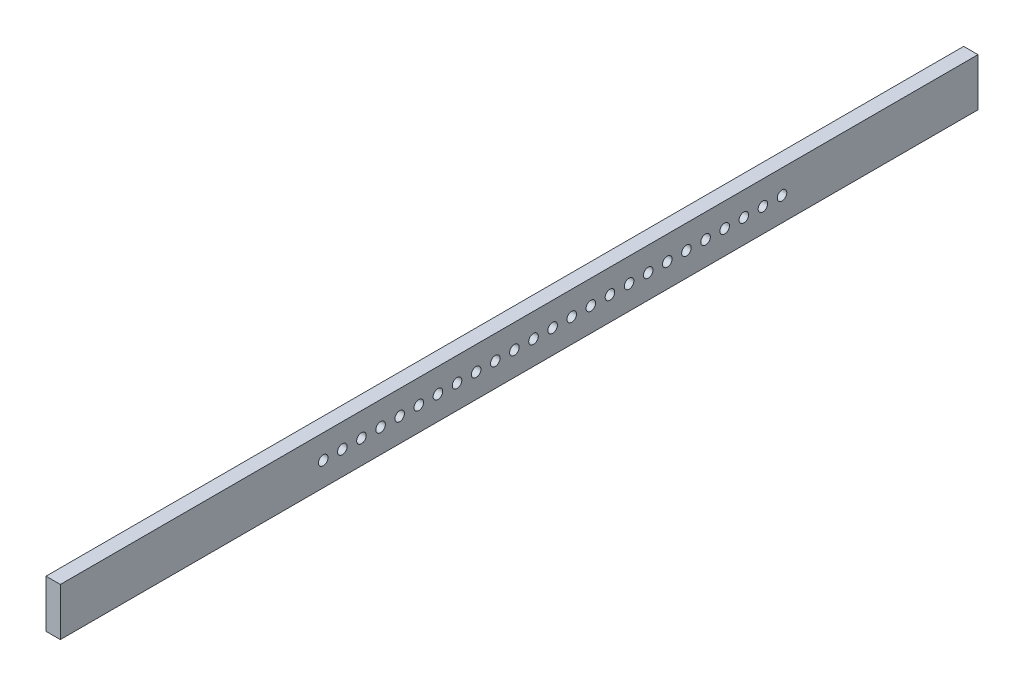
ISO-10303-21;
HEADER;
FILE_DESCRIPTION(('STEP AP214'),'2;1');
FILE_NAME('part.step','',(''),(''),'','','');
FILE_SCHEMA(('AUTOMOTIVE_DESIGN { 1 0 10303 214 1 1 1 1 }'));
ENDSEC;
DATA;
#1=APPLICATION_CONTEXT('core data for automotive mechanical design processes');
#2=APPLICATION_PROTOCOL_DEFINITION('international standard','automotive_design',2000,#1);
#3=PRODUCT_CONTEXT('',#1,'mechanical');
#4=PRODUCT('Part','Part','',(#3));
#5=PRODUCT_RELATED_PRODUCT_CATEGORY('part','',(#4));
#6=PRODUCT_DEFINITION_FORMATION('','',#4);
#7=PRODUCT_DEFINITION_CONTEXT('part definition',#1,'design');
#8=PRODUCT_DEFINITION('design','',#6,#7);
#9=PRODUCT_DEFINITION_SHAPE('','',#8);
#10=(LENGTH_UNIT() NAMED_UNIT(*) SI_UNIT(.MILLI.,.METRE.));
#11=(NAMED_UNIT(*) PLANE_ANGLE_UNIT() SI_UNIT($,.RADIAN.));
#12=(NAMED_UNIT(*) SI_UNIT($,.STERADIAN.) SOLID_ANGLE_UNIT());
#13=UNCERTAINTY_MEASURE_WITH_UNIT(LENGTH_MEASURE(1.E-05),#10,'distance_accuracy_value','');
#14=(GEOMETRIC_REPRESENTATION_CONTEXT(3) GLOBAL_UNCERTAINTY_ASSIGNED_CONTEXT((#13)) GLOBAL_UNIT_ASSIGNED_CONTEXT((#10,
#11,#12)) REPRESENTATION_CONTEXT('',''));
#15=CARTESIAN_POINT('',(0.,0.,0.));
#16=DIRECTION('',(0.,0.,1.));
#17=DIRECTION('',(1.,0.,0.));
#18=AXIS2_PLACEMENT_3D('',#15,#16,#17);
#19=CARTESIAN_POINT('',(15.,0.,0.));
#20=DIRECTION('',(1.,0.,0.));
#21=DIRECTION('',(0.,0.,-1.));
#22=AXIS2_PLACEMENT_3D('',#19,#20,#21);
#23=PLANE('',#22);
#24=CARTESIAN_POINT('',(15.,0.,-255.));
#25=DIRECTION('',(1.,0.,0.));
#26=DIRECTION('',(0.,0.,-1.));
#27=AXIS2_PLACEMENT_3D('',#24,#25,#26);
#28=CIRCLE('',#27,4.99999999999999);
#29=CARTESIAN_POINT('',(15.,0.,-260.));
#30=VERTEX_POINT('',#29);
#31=EDGE_CURVE('E246',#30,#30,#28,.T.);
#32=ORIENTED_EDGE('',*,*,#31,.F.);
#33=EDGE_LOOP('',(#32));
#34=FACE_BOUND('',#33,.T.);
#35=CARTESIAN_POINT('',(15.,0.,-215.));
#36=DIRECTION('',(1.,0.,0.));
#37=DIRECTION('',(0.,0.,-1.));
#38=AXIS2_PLACEMENT_3D('',#35,#36,#37);
#39=CIRCLE('',#38,4.99999999999999);
#40=CARTESIAN_POINT('',(15.,0.,-220.));
#41=VERTEX_POINT('',#40);
#42=EDGE_CURVE('E234',#41,#41,#39,.T.);
#43=ORIENTED_EDGE('',*,*,#42,.F.);
#44=EDGE_LOOP('',(#43));
#45=FACE_BOUND('',#44,.T.);
#46=CARTESIAN_POINT('',(15.,0.,-155.));
#47=DIRECTION('',(1.,0.,0.));
#48=DIRECTION('',(0.,0.,-1.));
#49=AXIS2_PLACEMENT_3D('',#46,#47,#48);
#50=CIRCLE('',#49,4.99999999999999);
#51=CARTESIAN_POINT('',(15.,0.,-160.));
#52=VERTEX_POINT('',#51);
#53=EDGE_CURVE('E222',#52,#52,#50,.T.);
#54=ORIENTED_EDGE('',*,*,#53,.F.);
#55=EDGE_LOOP('',(#54));
#56=FACE_BOUND('',#55,.T.);
#57=CARTESIAN_POINT('',(15.,0.,-115.));
#58=DIRECTION('',(1.,0.,0.));
#59=DIRECTION('',(0.,0.,-1.));
#60=AXIS2_PLACEMENT_3D('',#57,#58,#59);
#61=CIRCLE('',#60,4.99999999999999);
#62=CARTESIAN_POINT('',(15.,0.,-120.));
#63=VERTEX_POINT('',#62);
#64=EDGE_CURVE('E210',#63,#63,#61,.T.);
#65=ORIENTED_EDGE('',*,*,#64,.F.);
#66=EDGE_LOOP('',(#65));
#67=FACE_BOUND('',#66,.T.);
#68=CARTESIAN_POINT('',(15.,0.,-75.0000000000001));
#69=DIRECTION('',(1.,0.,0.));
#70=DIRECTION('',(0.,0.,-1.));
#71=AXIS2_PLACEMENT_3D('',#68,#69,#70);
#72=CIRCLE('',#71,4.99999999999999);
#73=CARTESIAN_POINT('',(15.,0.,-80.0000000000001));
#74=VERTEX_POINT('',#73);
#75=EDGE_CURVE('E198',#74,#74,#72,.T.);
#76=ORIENTED_EDGE('',*,*,#75,.F.);
#77=EDGE_LOOP('',(#76));
#78=FACE_BOUND('',#77,.T.);
#79=CARTESIAN_POINT('',(15.,0.,-35.0000000000001));
#80=DIRECTION('',(1.,0.,0.));
#81=DIRECTION('',(0.,0.,-1.));
#82=AXIS2_PLACEMENT_3D('',#79,#80,#81);
#83=CIRCLE('',#82,4.99999999999999);
#84=CARTESIAN_POINT('',(15.,0.,-40.0000000000001));
#85=VERTEX_POINT('',#84);
#86=EDGE_CURVE('E186',#85,#85,#83,.T.);
#87=ORIENTED_EDGE('',*,*,#86,.F.);
#88=EDGE_LOOP('',(#87));
#89=FACE_BOUND('',#88,.T.);
#90=CARTESIAN_POINT('',(15.,0.,4.99999999999989));
#91=DIRECTION('',(1.,0.,0.));
#92=DIRECTION('',(0.,0.,-1.));
#93=AXIS2_PLACEMENT_3D('',#90,#91,#92);
#94=CIRCLE('',#93,4.99999999999996);
#95=CARTESIAN_POINT('',(15.,0.,0.));
#96=VERTEX_POINT('',#95);
#97=EDGE_CURVE('E174',#96,#96,#94,.T.);
#98=ORIENTED_EDGE('',*,*,#97,.F.);
#99=EDGE_LOOP('',(#98));
#100=FACE_BOUND('',#99,.T.);
#101=CARTESIAN_POINT('',(15.,0.,44.9999999999999));
#102=DIRECTION('',(1.,0.,0.));
#103=DIRECTION('',(0.,0.,-1.));
#104=AXIS2_PLACEMENT_3D('',#101,#102,#103);
#105=CIRCLE('',#104,4.99999999999999);
#106=CARTESIAN_POINT('',(15.,0.,39.9999999999999));
#107=VERTEX_POINT('',#106);
#108=EDGE_CURVE('E162',#107,#107,#105,.T.);
#109=ORIENTED_EDGE('',*,*,#108,.F.);
#110=EDGE_LOOP('',(#109));
#111=FACE_BOUND('',#110,.T.);
#112=CARTESIAN_POINT('',(15.,0.,84.9999999999999));
#113=DIRECTION('',(1.,0.,0.));
#114=DIRECTION('',(0.,0.,-1.));
#115=AXIS2_PLACEMENT_3D('',#112,#113,#114);
#116=CIRCLE('',#115,5.00000000000005);
#117=CARTESIAN_POINT('',(15.,0.,79.9999999999999));
#118=VERTEX_POINT('',#117);
#119=EDGE_CURVE('E150',#118,#118,#116,.T.);
#120=ORIENTED_EDGE('',*,*,#119,.F.);
#121=EDGE_LOOP('',(#120));
#122=FACE_BOUND('',#121,.T.);
#123=CARTESIAN_POINT('',(15.,0.,125.));
#124=DIRECTION('',(1.,0.,0.));
#125=DIRECTION('',(0.,0.,-1.));
#126=AXIS2_PLACEMENT_3D('',#123,#124,#125);
#127=CIRCLE('',#126,4.99999999999999);
#128=CARTESIAN_POINT('',(15.,0.,120.));
#129=VERTEX_POINT('',#128);
#130=EDGE_CURVE('E138',#129,#129,#127,.T.);
#131=ORIENTED_EDGE('',*,*,#130,.F.);
#132=EDGE_LOOP('',(#131));
#133=FACE_BOUND('',#132,.T.);
#134=CARTESIAN_POINT('',(15.,0.,165.));
#135=DIRECTION('',(1.,0.,0.));
#136=DIRECTION('',(0.,0.,-1.));
#137=AXIS2_PLACEMENT_3D('',#134,#135,#136);
#138=CIRCLE('',#137,4.99999999999993);
#139=CARTESIAN_POINT('',(15.,0.,160.));
#140=VERTEX_POINT('',#139);
#141=EDGE_CURVE('E126',#140,#140,#138,.T.);
#142=ORIENTED_EDGE('',*,*,#141,.F.);
#143=EDGE_LOOP('',(#142));
#144=FACE_BOUND('',#143,.T.);
#145=CARTESIAN_POINT('',(15.,0.,-195.));
#146=DIRECTION('',(1.,0.,0.));
#147=DIRECTION('',(0.,0.,-1.));
#148=AXIS2_PLACEMENT_3D('',#145,#146,#147);
#149=CIRCLE('',#148,4.99999999999999);
#150=CARTESIAN_POINT('',(15.,0.,-200.));
#151=VERTEX_POINT('',#150);
#152=EDGE_CURVE('E114',#151,#151,#149,.T.);
#153=ORIENTED_EDGE('',*,*,#152,.F.);
#154=EDGE_LOOP('',(#153));
#155=FACE_BOUND('',#154,.T.);
#156=DIRECTION('',(0.,1.,0.));
#157=VECTOR('',#156,1.);
#158=CARTESIAN_POINT('',(15.,25.,-480.));
#159=LINE('',#158,#157);
#160=CARTESIAN_POINT('',(15.,-25.,-480.));
#161=VERTEX_POINT('',#160);
#162=CARTESIAN_POINT('',(15.,25.,-480.));
#163=VERTEX_POINT('',#162);
#164=EDGE_CURVE('E84',#161,#163,#159,.T.);
#165=ORIENTED_EDGE('',*,*,#164,.T.);
#166=DIRECTION('',(0.,0.,1.));
#167=VECTOR('',#166,1.);
#168=CARTESIAN_POINT('',(15.,25.,480.));
#169=LINE('',#168,#167);
#170=CARTESIAN_POINT('',(15.,25.,480.));
#171=VERTEX_POINT('',#170);
#172=EDGE_CURVE('E79',#163,#171,#169,.T.);
#173=ORIENTED_EDGE('',*,*,#172,.T.);
#174=DIRECTION('',(0.,-1.,0.));
#175=VECTOR('',#174,1.);
#176=CARTESIAN_POINT('',(15.,25.,480.));
#177=LINE('',#176,#175);
#178=CARTESIAN_POINT('',(15.,-25.,480.));
#179=VERTEX_POINT('',#178);
#180=EDGE_CURVE('E82',#171,#179,#177,.T.);
#181=ORIENTED_EDGE('',*,*,#180,.T.);
#182=DIRECTION('',(0.,0.,-1.));
#183=VECTOR('',#182,1.);
#184=CARTESIAN_POINT('',(15.,-25.,480.));
#185=LINE('',#184,#183);
#186=EDGE_CURVE('E49',#179,#161,#185,.T.);
#187=ORIENTED_EDGE('',*,*,#186,.T.);
#188=EDGE_LOOP('',(#165,#173,#181,#187));
#189=FACE_BOUND('',#188,.T.);
#190=CARTESIAN_POINT('',(15.,0.,205.));
#191=DIRECTION('',(1.,0.,0.));
#192=DIRECTION('',(0.,0.,-1.));
#193=AXIS2_PLACEMENT_3D('',#190,#191,#192);
#194=CIRCLE('',#193,4.99999999999999);
#195=CARTESIAN_POINT('',(15.,0.,200.));
#196=VERTEX_POINT('',#195);
#197=EDGE_CURVE('E99',#196,#196,#194,.T.);
#198=ORIENTED_EDGE('',*,*,#197,.F.);
#199=EDGE_LOOP('',(#198));
#200=FACE_BOUND('',#199,.T.);
#201=CARTESIAN_POINT('',(15.,0.,185.));
#202=DIRECTION('',(1.,0.,0.));
#203=DIRECTION('',(0.,0.,-1.));
#204=AXIS2_PLACEMENT_3D('',#201,#202,#203);
#205=CIRCLE('',#204,4.99999999999999);
#206=CARTESIAN_POINT('',(15.,0.,180.));
#207=VERTEX_POINT('',#206);
#208=EDGE_CURVE('E120',#207,#207,#205,.T.);
#209=ORIENTED_EDGE('',*,*,#208,.F.);
#210=EDGE_LOOP('',(#209));
#211=FACE_BOUND('',#210,.T.);
#212=CARTESIAN_POINT('',(15.,0.,145.));
#213=DIRECTION('',(1.,0.,0.));
#214=DIRECTION('',(0.,0.,-1.));
#215=AXIS2_PLACEMENT_3D('',#212,#213,#214);
#216=CIRCLE('',#215,4.99999999999999);
#217=CARTESIAN_POINT('',(15.,0.,140.));
#218=VERTEX_POINT('',#217);
#219=EDGE_CURVE('E132',#218,#218,#216,.T.);
#220=ORIENTED_EDGE('',*,*,#219,.F.);
#221=EDGE_LOOP('',(#220));
#222=FACE_BOUND('',#221,.T.);
#223=CARTESIAN_POINT('',(15.,0.,105.));
#224=DIRECTION('',(1.,0.,0.));
#225=DIRECTION('',(0.,0.,-1.));
#226=AXIS2_PLACEMENT_3D('',#223,#224,#225);
#227=CIRCLE('',#226,4.99999999999999);
#228=CARTESIAN_POINT('',(15.,0.,99.9999999999999));
#229=VERTEX_POINT('',#228);
#230=EDGE_CURVE('E144',#229,#229,#227,.T.);
#231=ORIENTED_EDGE('',*,*,#230,.F.);
#232=EDGE_LOOP('',(#231));
#233=FACE_BOUND('',#232,.T.);
#234=CARTESIAN_POINT('',(15.,0.,64.9999999999999));
#235=DIRECTION('',(1.,0.,0.));
#236=DIRECTION('',(0.,0.,-1.));
#237=AXIS2_PLACEMENT_3D('',#234,#235,#236);
#238=CIRCLE('',#237,4.99999999999999);
#239=CARTESIAN_POINT('',(15.,0.,59.9999999999999));
#240=VERTEX_POINT('',#239);
#241=EDGE_CURVE('E156',#240,#240,#238,.T.);
#242=ORIENTED_EDGE('',*,*,#241,.F.);
#243=EDGE_LOOP('',(#242));
#244=FACE_BOUND('',#243,.T.);
#245=CARTESIAN_POINT('',(15.,0.,24.9999999999999));
#246=DIRECTION('',(1.,0.,0.));
#247=DIRECTION('',(0.,0.,-1.));
#248=AXIS2_PLACEMENT_3D('',#245,#246,#247);
#249=CIRCLE('',#248,4.99999999999999);
#250=CARTESIAN_POINT('',(15.,0.,19.9999999999999));
#251=VERTEX_POINT('',#250);
#252=EDGE_CURVE('E168',#251,#251,#249,.T.);
#253=ORIENTED_EDGE('',*,*,#252,.F.);
#254=EDGE_LOOP('',(#253));
#255=FACE_BOUND('',#254,.T.);
#256=CARTESIAN_POINT('',(15.,0.,-15.0000000000001));
#257=DIRECTION('',(1.,0.,0.));
#258=DIRECTION('',(0.,0.,-1.));
#259=AXIS2_PLACEMENT_3D('',#256,#257,#258);
#260=CIRCLE('',#259,4.99999999999999);
#261=CARTESIAN_POINT('',(15.,0.,-20.0000000000001));
#262=VERTEX_POINT('',#261);
#263=EDGE_CURVE('E180',#262,#262,#260,.T.);
#264=ORIENTED_EDGE('',*,*,#263,.F.);
#265=EDGE_LOOP('',(#264));
#266=FACE_BOUND('',#265,.T.);
#267=CARTESIAN_POINT('',(15.,0.,-55.0000000000001));
#268=DIRECTION('',(1.,0.,0.));
#269=DIRECTION('',(0.,0.,-1.));
#270=AXIS2_PLACEMENT_3D('',#267,#268,#269);
#271=CIRCLE('',#270,4.99999999999999);
#272=CARTESIAN_POINT('',(15.,0.,-60.0000000000001));
#273=VERTEX_POINT('',#272);
#274=EDGE_CURVE('E192',#273,#273,#271,.T.);
#275=ORIENTED_EDGE('',*,*,#274,.F.);
#276=EDGE_LOOP('',(#275));
#277=FACE_BOUND('',#276,.T.);
#278=CARTESIAN_POINT('',(15.,0.,-95.0000000000001));
#279=DIRECTION('',(1.,0.,0.));
#280=DIRECTION('',(0.,0.,-1.));
#281=AXIS2_PLACEMENT_3D('',#278,#279,#280);
#282=CIRCLE('',#281,4.99999999999999);
#283=CARTESIAN_POINT('',(15.,0.,-100.));
#284=VERTEX_POINT('',#283);
#285=EDGE_CURVE('E204',#284,#284,#282,.T.);
#286=ORIENTED_EDGE('',*,*,#285,.F.);
#287=EDGE_LOOP('',(#286));
#288=FACE_BOUND('',#287,.T.);
#289=CARTESIAN_POINT('',(15.,0.,-135.));
#290=DIRECTION('',(1.,0.,0.));
#291=DIRECTION('',(0.,0.,-1.));
#292=AXIS2_PLACEMENT_3D('',#289,#290,#291);
#293=CIRCLE('',#292,4.99999999999999);
#294=CARTESIAN_POINT('',(15.,0.,-140.));
#295=VERTEX_POINT('',#294);
#296=EDGE_CURVE('E216',#295,#295,#293,.T.);
#297=ORIENTED_EDGE('',*,*,#296,.F.);
#298=EDGE_LOOP('',(#297));
#299=FACE_BOUND('',#298,.T.);
#300=CARTESIAN_POINT('',(15.,0.,-175.));
#301=DIRECTION('',(1.,0.,0.));
#302=DIRECTION('',(0.,0.,-1.));
#303=AXIS2_PLACEMENT_3D('',#300,#301,#302);
#304=CIRCLE('',#303,4.99999999999999);
#305=CARTESIAN_POINT('',(15.,0.,-180.));
#306=VERTEX_POINT('',#305);
#307=EDGE_CURVE('E228',#306,#306,#304,.T.);
#308=ORIENTED_EDGE('',*,*,#307,.F.);
#309=EDGE_LOOP('',(#308));
#310=FACE_BOUND('',#309,.T.);
#311=CARTESIAN_POINT('',(15.,0.,-235.));
#312=DIRECTION('',(1.,0.,0.));
#313=DIRECTION('',(0.,0.,-1.));
#314=AXIS2_PLACEMENT_3D('',#311,#312,#313);
#315=CIRCLE('',#314,4.99999999999999);
#316=CARTESIAN_POINT('',(15.,0.,-240.));
#317=VERTEX_POINT('',#316);
#318=EDGE_CURVE('E240',#317,#317,#315,.T.);
#319=ORIENTED_EDGE('',*,*,#318,.F.);
#320=EDGE_LOOP('',(#319));
#321=FACE_BOUND('',#320,.T.);
#322=CARTESIAN_POINT('',(15.,0.,-275.));
#323=DIRECTION('',(1.,0.,0.));
#324=DIRECTION('',(0.,0.,-1.));
#325=AXIS2_PLACEMENT_3D('',#322,#323,#324);
#326=CIRCLE('',#325,4.99999999999999);
#327=CARTESIAN_POINT('',(15.,0.,-280.));
#328=VERTEX_POINT('',#327);
#329=EDGE_CURVE('E252',#328,#328,#326,.T.);
#330=ORIENTED_EDGE('',*,*,#329,.F.);
#331=EDGE_LOOP('',(#330));
#332=FACE_BOUND('',#331,.T.);
#333=ADVANCED_FACE('F32',(#34,#45,#56,#67,#78,#89,#100,#111,#122,#133,#144,#155,#189,#200,#211,
#222,#233,#244,#255,#266,#277,#288,#299,#310,#321,#332),#23,.T.);
#334=CARTESIAN_POINT('',(0.,0.,0.));
#335=DIRECTION('',(1.,0.,0.));
#336=DIRECTION('',(0.,0.,-1.));
#337=AXIS2_PLACEMENT_3D('',#334,#335,#336);
#338=PLANE('',#337);
#339=CARTESIAN_POINT('',(0.,0.,-255.));
#340=DIRECTION('',(1.,0.,0.));
#341=DIRECTION('',(0.,0.,-1.));
#342=AXIS2_PLACEMENT_3D('',#339,#340,#341);
#343=CIRCLE('',#342,4.99999999999999);
#344=CARTESIAN_POINT('',(0.,0.,-260.));
#345=VERTEX_POINT('',#344);
#346=EDGE_CURVE('E249',#345,#345,#343,.T.);
#347=ORIENTED_EDGE('',*,*,#346,.T.);
#348=EDGE_LOOP('',(#347));
#349=FACE_BOUND('',#348,.T.);
#350=CARTESIAN_POINT('',(0.,0.,-215.));
#351=DIRECTION('',(1.,0.,0.));
#352=DIRECTION('',(0.,0.,-1.));
#353=AXIS2_PLACEMENT_3D('',#350,#351,#352);
#354=CIRCLE('',#353,4.99999999999999);
#355=CARTESIAN_POINT('',(0.,0.,-220.));
#356=VERTEX_POINT('',#355);
#357=EDGE_CURVE('E237',#356,#356,#354,.T.);
#358=ORIENTED_EDGE('',*,*,#357,.T.);
#359=EDGE_LOOP('',(#358));
#360=FACE_BOUND('',#359,.T.);
#361=CARTESIAN_POINT('',(0.,0.,-155.));
#362=DIRECTION('',(1.,0.,0.));
#363=DIRECTION('',(0.,0.,-1.));
#364=AXIS2_PLACEMENT_3D('',#361,#362,#363);
#365=CIRCLE('',#364,4.99999999999999);
#366=CARTESIAN_POINT('',(0.,0.,-160.));
#367=VERTEX_POINT('',#366);
#368=EDGE_CURVE('E225',#367,#367,#365,.T.);
#369=ORIENTED_EDGE('',*,*,#368,.T.);
#370=EDGE_LOOP('',(#369));
#371=FACE_BOUND('',#370,.T.);
#372=CARTESIAN_POINT('',(0.,0.,-115.));
#373=DIRECTION('',(1.,0.,0.));
#374=DIRECTION('',(0.,0.,-1.));
#375=AXIS2_PLACEMENT_3D('',#372,#373,#374);
#376=CIRCLE('',#375,4.99999999999999);
#377=CARTESIAN_POINT('',(0.,0.,-120.));
#378=VERTEX_POINT('',#377);
#379=EDGE_CURVE('E213',#378,#378,#376,.T.);
#380=ORIENTED_EDGE('',*,*,#379,.T.);
#381=EDGE_LOOP('',(#380));
#382=FACE_BOUND('',#381,.T.);
#383=CARTESIAN_POINT('',(0.,0.,-75.0000000000001));
#384=DIRECTION('',(1.,0.,0.));
#385=DIRECTION('',(0.,0.,-1.));
#386=AXIS2_PLACEMENT_3D('',#383,#384,#385);
#387=CIRCLE('',#386,4.99999999999999);
#388=CARTESIAN_POINT('',(0.,0.,-80.0000000000001));
#389=VERTEX_POINT('',#388);
#390=EDGE_CURVE('E201',#389,#389,#387,.T.);
#391=ORIENTED_EDGE('',*,*,#390,.T.);
#392=EDGE_LOOP('',(#391));
#393=FACE_BOUND('',#392,.T.);
#394=CARTESIAN_POINT('',(0.,0.,-35.0000000000001));
#395=DIRECTION('',(1.,0.,0.));
#396=DIRECTION('',(0.,0.,-1.));
#397=AXIS2_PLACEMENT_3D('',#394,#395,#396);
#398=CIRCLE('',#397,4.99999999999999);
#399=CARTESIAN_POINT('',(0.,0.,-40.0000000000001));
#400=VERTEX_POINT('',#399);
#401=EDGE_CURVE('E189',#400,#400,#398,.T.);
#402=ORIENTED_EDGE('',*,*,#401,.T.);
#403=EDGE_LOOP('',(#402));
#404=FACE_BOUND('',#403,.T.);
#405=CARTESIAN_POINT('',(0.,0.,4.99999999999989));
#406=DIRECTION('',(1.,0.,0.));
#407=DIRECTION('',(0.,0.,-1.));
#408=AXIS2_PLACEMENT_3D('',#405,#406,#407);
#409=CIRCLE('',#408,4.99999999999996);
#410=CARTESIAN_POINT('',(0.,0.,0.));
#411=VERTEX_POINT('',#410);
#412=EDGE_CURVE('E177',#411,#411,#409,.T.);
#413=ORIENTED_EDGE('',*,*,#412,.T.);
#414=EDGE_LOOP('',(#413));
#415=FACE_BOUND('',#414,.T.);
#416=CARTESIAN_POINT('',(0.,0.,44.9999999999999));
#417=DIRECTION('',(1.,0.,0.));
#418=DIRECTION('',(0.,0.,-1.));
#419=AXIS2_PLACEMENT_3D('',#416,#417,#418);
#420=CIRCLE('',#419,4.99999999999999);
#421=CARTESIAN_POINT('',(0.,0.,39.9999999999999));
#422=VERTEX_POINT('',#421);
#423=EDGE_CURVE('E165',#422,#422,#420,.T.);
#424=ORIENTED_EDGE('',*,*,#423,.T.);
#425=EDGE_LOOP('',(#424));
#426=FACE_BOUND('',#425,.T.);
#427=CARTESIAN_POINT('',(0.,0.,84.9999999999999));
#428=DIRECTION('',(1.,0.,0.));
#429=DIRECTION('',(0.,0.,-1.));
#430=AXIS2_PLACEMENT_3D('',#427,#428,#429);
#431=CIRCLE('',#430,5.00000000000005);
#432=CARTESIAN_POINT('',(0.,0.,79.9999999999999));
#433=VERTEX_POINT('',#432);
#434=EDGE_CURVE('E153',#433,#433,#431,.T.);
#435=ORIENTED_EDGE('',*,*,#434,.T.);
#436=EDGE_LOOP('',(#435));
#437=FACE_BOUND('',#436,.T.);
#438=CARTESIAN_POINT('',(0.,0.,125.));
#439=DIRECTION('',(1.,0.,0.));
#440=DIRECTION('',(0.,0.,-1.));
#441=AXIS2_PLACEMENT_3D('',#438,#439,#440);
#442=CIRCLE('',#441,4.99999999999999);
#443=CARTESIAN_POINT('',(0.,0.,120.));
#444=VERTEX_POINT('',#443);
#445=EDGE_CURVE('E141',#444,#444,#442,.T.);
#446=ORIENTED_EDGE('',*,*,#445,.T.);
#447=EDGE_LOOP('',(#446));
#448=FACE_BOUND('',#447,.T.);
#449=CARTESIAN_POINT('',(0.,0.,165.));
#450=DIRECTION('',(1.,0.,0.));
#451=DIRECTION('',(0.,0.,-1.));
#452=AXIS2_PLACEMENT_3D('',#449,#450,#451);
#453=CIRCLE('',#452,4.99999999999993);
#454=CARTESIAN_POINT('',(0.,0.,160.));
#455=VERTEX_POINT('',#454);
#456=EDGE_CURVE('E129',#455,#455,#453,.T.);
#457=ORIENTED_EDGE('',*,*,#456,.T.);
#458=EDGE_LOOP('',(#457));
#459=FACE_BOUND('',#458,.T.);
#460=CARTESIAN_POINT('',(0.,0.,-195.));
#461=DIRECTION('',(1.,0.,0.));
#462=DIRECTION('',(0.,0.,-1.));
#463=AXIS2_PLACEMENT_3D('',#460,#461,#462);
#464=CIRCLE('',#463,4.99999999999999);
#465=CARTESIAN_POINT('',(0.,0.,-200.));
#466=VERTEX_POINT('',#465);
#467=EDGE_CURVE('E117',#466,#466,#464,.T.);
#468=ORIENTED_EDGE('',*,*,#467,.T.);
#469=EDGE_LOOP('',(#468));
#470=FACE_BOUND('',#469,.T.);
#471=DIRECTION('',(0.,1.,0.));
#472=VECTOR('',#471,1.);
#473=CARTESIAN_POINT('',(0.,25.,-480.));
#474=LINE('',#473,#472);
#475=CARTESIAN_POINT('',(0.,-25.,-480.));
#476=VERTEX_POINT('',#475);
#477=CARTESIAN_POINT('',(0.,25.,-480.));
#478=VERTEX_POINT('',#477);
#479=EDGE_CURVE('E96',#476,#478,#474,.T.);
#480=ORIENTED_EDGE('',*,*,#479,.F.);
#481=DIRECTION('',(0.,0.,-1.));
#482=VECTOR('',#481,1.);
#483=CARTESIAN_POINT('',(0.,-25.,480.));
#484=LINE('',#483,#482);
#485=CARTESIAN_POINT('',(0.,-25.,480.));
#486=VERTEX_POINT('',#485);
#487=EDGE_CURVE('E72',#486,#476,#484,.T.);
#488=ORIENTED_EDGE('',*,*,#487,.F.);
#489=DIRECTION('',(0.,-1.,0.));
#490=VECTOR('',#489,1.);
#491=CARTESIAN_POINT('',(0.,25.,480.));
#492=LINE('',#491,#490);
#493=CARTESIAN_POINT('',(0.,25.,480.));
#494=VERTEX_POINT('',#493);
#495=EDGE_CURVE('E66',#494,#486,#492,.T.);
#496=ORIENTED_EDGE('',*,*,#495,.F.);
#497=DIRECTION('',(0.,0.,1.));
#498=VECTOR('',#497,1.);
#499=CARTESIAN_POINT('',(0.,25.,480.));
#500=LINE('',#499,#498);
#501=EDGE_CURVE('E88',#478,#494,#500,.T.);
#502=ORIENTED_EDGE('',*,*,#501,.F.);
#503=EDGE_LOOP('',(#480,#488,#496,#502));
#504=FACE_BOUND('',#503,.T.);
#505=CARTESIAN_POINT('',(0.,0.,205.));
#506=DIRECTION('',(1.,0.,0.));
#507=DIRECTION('',(0.,0.,-1.));
#508=AXIS2_PLACEMENT_3D('',#505,#506,#507);
#509=CIRCLE('',#508,4.99999999999999);
#510=CARTESIAN_POINT('',(0.,0.,200.));
#511=VERTEX_POINT('',#510);
#512=EDGE_CURVE('E111',#511,#511,#509,.T.);
#513=ORIENTED_EDGE('',*,*,#512,.T.);
#514=EDGE_LOOP('',(#513));
#515=FACE_BOUND('',#514,.T.);
#516=CARTESIAN_POINT('',(0.,0.,185.));
#517=DIRECTION('',(1.,0.,0.));
#518=DIRECTION('',(0.,0.,-1.));
#519=AXIS2_PLACEMENT_3D('',#516,#517,#518);
#520=CIRCLE('',#519,4.99999999999999);
#521=CARTESIAN_POINT('',(0.,0.,180.));
#522=VERTEX_POINT('',#521);
#523=EDGE_CURVE('E123',#522,#522,#520,.T.);
#524=ORIENTED_EDGE('',*,*,#523,.T.);
#525=EDGE_LOOP('',(#524));
#526=FACE_BOUND('',#525,.T.);
#527=CARTESIAN_POINT('',(0.,0.,145.));
#528=DIRECTION('',(1.,0.,0.));
#529=DIRECTION('',(0.,0.,-1.));
#530=AXIS2_PLACEMENT_3D('',#527,#528,#529);
#531=CIRCLE('',#530,4.99999999999999);
#532=CARTESIAN_POINT('',(0.,0.,140.));
#533=VERTEX_POINT('',#532);
#534=EDGE_CURVE('E135',#533,#533,#531,.T.);
#535=ORIENTED_EDGE('',*,*,#534,.T.);
#536=EDGE_LOOP('',(#535));
#537=FACE_BOUND('',#536,.T.);
#538=CARTESIAN_POINT('',(0.,0.,105.));
#539=DIRECTION('',(1.,0.,0.));
#540=DIRECTION('',(0.,0.,-1.));
#541=AXIS2_PLACEMENT_3D('',#538,#539,#540);
#542=CIRCLE('',#541,4.99999999999999);
#543=CARTESIAN_POINT('',(0.,0.,99.9999999999999));
#544=VERTEX_POINT('',#543);
#545=EDGE_CURVE('E147',#544,#544,#542,.T.);
#546=ORIENTED_EDGE('',*,*,#545,.T.);
#547=EDGE_LOOP('',(#546));
#548=FACE_BOUND('',#547,.T.);
#549=CARTESIAN_POINT('',(0.,0.,64.9999999999999));
#550=DIRECTION('',(1.,0.,0.));
#551=DIRECTION('',(0.,0.,-1.));
#552=AXIS2_PLACEMENT_3D('',#549,#550,#551);
#553=CIRCLE('',#552,4.99999999999999);
#554=CARTESIAN_POINT('',(0.,0.,59.9999999999999));
#555=VERTEX_POINT('',#554);
#556=EDGE_CURVE('E159',#555,#555,#553,.T.);
#557=ORIENTED_EDGE('',*,*,#556,.T.);
#558=EDGE_LOOP('',(#557));
#559=FACE_BOUND('',#558,.T.);
#560=CARTESIAN_POINT('',(0.,0.,24.9999999999999));
#561=DIRECTION('',(1.,0.,0.));
#562=DIRECTION('',(0.,0.,-1.));
#563=AXIS2_PLACEMENT_3D('',#560,#561,#562);
#564=CIRCLE('',#563,4.99999999999999);
#565=CARTESIAN_POINT('',(0.,0.,19.9999999999999));
#566=VERTEX_POINT('',#565);
#567=EDGE_CURVE('E171',#566,#566,#564,.T.);
#568=ORIENTED_EDGE('',*,*,#567,.T.);
#569=EDGE_LOOP('',(#568));
#570=FACE_BOUND('',#569,.T.);
#571=CARTESIAN_POINT('',(0.,0.,-15.0000000000001));
#572=DIRECTION('',(1.,0.,0.));
#573=DIRECTION('',(0.,0.,-1.));
#574=AXIS2_PLACEMENT_3D('',#571,#572,#573);
#575=CIRCLE('',#574,4.99999999999999);
#576=CARTESIAN_POINT('',(0.,0.,-20.0000000000001));
#577=VERTEX_POINT('',#576);
#578=EDGE_CURVE('E183',#577,#577,#575,.T.);
#579=ORIENTED_EDGE('',*,*,#578,.T.);
#580=EDGE_LOOP('',(#579));
#581=FACE_BOUND('',#580,.T.);
#582=CARTESIAN_POINT('',(0.,0.,-55.0000000000001));
#583=DIRECTION('',(1.,0.,0.));
#584=DIRECTION('',(0.,0.,-1.));
#585=AXIS2_PLACEMENT_3D('',#582,#583,#584);
#586=CIRCLE('',#585,4.99999999999999);
#587=CARTESIAN_POINT('',(0.,0.,-60.0000000000001));
#588=VERTEX_POINT('',#587);
#589=EDGE_CURVE('E195',#588,#588,#586,.T.);
#590=ORIENTED_EDGE('',*,*,#589,.T.);
#591=EDGE_LOOP('',(#590));
#592=FACE_BOUND('',#591,.T.);
#593=CARTESIAN_POINT('',(0.,0.,-95.0000000000001));
#594=DIRECTION('',(1.,0.,0.));
#595=DIRECTION('',(0.,0.,-1.));
#596=AXIS2_PLACEMENT_3D('',#593,#594,#595);
#597=CIRCLE('',#596,4.99999999999999);
#598=CARTESIAN_POINT('',(0.,0.,-100.));
#599=VERTEX_POINT('',#598);
#600=EDGE_CURVE('E207',#599,#599,#597,.T.);
#601=ORIENTED_EDGE('',*,*,#600,.T.);
#602=EDGE_LOOP('',(#601));
#603=FACE_BOUND('',#602,.T.);
#604=CARTESIAN_POINT('',(0.,0.,-135.));
#605=DIRECTION('',(1.,0.,0.));
#606=DIRECTION('',(0.,0.,-1.));
#607=AXIS2_PLACEMENT_3D('',#604,#605,#606);
#608=CIRCLE('',#607,4.99999999999999);
#609=CARTESIAN_POINT('',(0.,0.,-140.));
#610=VERTEX_POINT('',#609);
#611=EDGE_CURVE('E219',#610,#610,#608,.T.);
#612=ORIENTED_EDGE('',*,*,#611,.T.);
#613=EDGE_LOOP('',(#612));
#614=FACE_BOUND('',#613,.T.);
#615=CARTESIAN_POINT('',(0.,0.,-175.));
#616=DIRECTION('',(1.,0.,0.));
#617=DIRECTION('',(0.,0.,-1.));
#618=AXIS2_PLACEMENT_3D('',#615,#616,#617);
#619=CIRCLE('',#618,4.99999999999999);
#620=CARTESIAN_POINT('',(0.,0.,-180.));
#621=VERTEX_POINT('',#620);
#622=EDGE_CURVE('E231',#621,#621,#619,.T.);
#623=ORIENTED_EDGE('',*,*,#622,.T.);
#624=EDGE_LOOP('',(#623));
#625=FACE_BOUND('',#624,.T.);
#626=CARTESIAN_POINT('',(0.,0.,-235.));
#627=DIRECTION('',(1.,0.,0.));
#628=DIRECTION('',(0.,0.,-1.));
#629=AXIS2_PLACEMENT_3D('',#626,#627,#628);
#630=CIRCLE('',#629,4.99999999999999);
#631=CARTESIAN_POINT('',(0.,0.,-240.));
#632=VERTEX_POINT('',#631);
#633=EDGE_CURVE('E243',#632,#632,#630,.T.);
#634=ORIENTED_EDGE('',*,*,#633,.T.);
#635=EDGE_LOOP('',(#634));
#636=FACE_BOUND('',#635,.T.);
#637=CARTESIAN_POINT('',(0.,0.,-275.));
#638=DIRECTION('',(1.,0.,0.));
#639=DIRECTION('',(0.,0.,-1.));
#640=AXIS2_PLACEMENT_3D('',#637,#638,#639);
#641=CIRCLE('',#640,4.99999999999999);
#642=CARTESIAN_POINT('',(0.,0.,-280.));
#643=VERTEX_POINT('',#642);
#644=EDGE_CURVE('E255',#643,#643,#641,.T.);
#645=ORIENTED_EDGE('',*,*,#644,.T.);
#646=EDGE_LOOP('',(#645));
#647=FACE_BOUND('',#646,.T.);
#648=ADVANCED_FACE('F107',(#349,#360,#371,#382,#393,#404,#415,#426,#437,#448,#459,#470,#504,
#515,#526,#537,#548,#559,#570,#581,#592,#603,#614,#625,#636,#647),#338,.F.);
#649=CARTESIAN_POINT('',(15.,25.,-480.));
#650=DIRECTION('',(0.,0.,1.));
#651=DIRECTION('',(1.,0.,0.));
#652=AXIS2_PLACEMENT_3D('',#649,#650,#651);
#653=PLANE('',#652);
#654=ORIENTED_EDGE('',*,*,#479,.T.);
#655=DIRECTION('',(-1.,0.,0.));
#656=VECTOR('',#655,1.);
#657=CARTESIAN_POINT('',(15.,25.,-480.));
#658=LINE('',#657,#656);
#659=EDGE_CURVE('E11',#163,#478,#658,.T.);
#660=ORIENTED_EDGE('',*,*,#659,.F.);
#661=ORIENTED_EDGE('',*,*,#164,.F.);
#662=DIRECTION('',(-1.,0.,0.));
#663=VECTOR('',#662,1.);
#664=CARTESIAN_POINT('',(15.,-25.,-480.));
#665=LINE('',#664,#663);
#666=EDGE_CURVE('E92',#161,#476,#665,.T.);
#667=ORIENTED_EDGE('',*,*,#666,.T.);
#668=EDGE_LOOP('',(#654,#660,#661,#667));
#669=FACE_BOUND('',#668,.T.);
#670=ADVANCED_FACE('F34',(#669),#653,.F.);
#671=CARTESIAN_POINT('',(15.,25.,480.));
#672=DIRECTION('',(0.,-1.,0.));
#673=DIRECTION('',(0.,0.,-1.));
#674=AXIS2_PLACEMENT_3D('',#671,#672,#673);
#675=PLANE('',#674);
#676=ORIENTED_EDGE('',*,*,#501,.T.);
#677=DIRECTION('',(-1.,0.,0.));
#678=VECTOR('',#677,1.);
#679=CARTESIAN_POINT('',(15.,25.,480.));
#680=LINE('',#679,#678);
#681=EDGE_CURVE('E41',#171,#494,#680,.T.);
#682=ORIENTED_EDGE('',*,*,#681,.F.);
#683=ORIENTED_EDGE('',*,*,#172,.F.);
#684=ORIENTED_EDGE('',*,*,#659,.T.);
#685=EDGE_LOOP('',(#676,#682,#683,#684));
#686=FACE_BOUND('',#685,.T.);
#687=ADVANCED_FACE('F87',(#686),#675,.F.);
#688=CARTESIAN_POINT('',(15.,25.,480.));
#689=DIRECTION('',(0.,0.,-1.));
#690=DIRECTION('',(-1.,0.,0.));
#691=AXIS2_PLACEMENT_3D('',#688,#689,#690);
#692=PLANE('',#691);
#693=ORIENTED_EDGE('',*,*,#495,.T.);
#694=DIRECTION('',(-1.,0.,0.));
#695=VECTOR('',#694,1.);
#696=CARTESIAN_POINT('',(15.,-25.,480.));
#697=LINE('',#696,#695);
#698=EDGE_CURVE('E89',#179,#486,#697,.T.);
#699=ORIENTED_EDGE('',*,*,#698,.F.);
#700=ORIENTED_EDGE('',*,*,#180,.F.);
#701=ORIENTED_EDGE('',*,*,#681,.T.);
#702=EDGE_LOOP('',(#693,#699,#700,#701));
#703=FACE_BOUND('',#702,.T.);
#704=ADVANCED_FACE('F90',(#703),#692,.F.);
#705=CARTESIAN_POINT('',(15.,-25.,480.));
#706=DIRECTION('',(0.,1.,0.));
#707=DIRECTION('',(0.,0.,1.));
#708=AXIS2_PLACEMENT_3D('',#705,#706,#707);
#709=PLANE('',#708);
#710=ORIENTED_EDGE('',*,*,#487,.T.);
#711=ORIENTED_EDGE('',*,*,#666,.F.);
#712=ORIENTED_EDGE('',*,*,#186,.F.);
#713=ORIENTED_EDGE('',*,*,#698,.T.);
#714=EDGE_LOOP('',(#710,#711,#712,#713));
#715=FACE_BOUND('',#714,.T.);
#716=ADVANCED_FACE('F104',(#715),#709,.F.);
#717=CARTESIAN_POINT('',(15.,0.,205.));
#718=DIRECTION('',(-1.,0.,0.));
#719=DIRECTION('',(0.,0.,1.));
#720=AXIS2_PLACEMENT_3D('',#717,#718,#719);
#721=CYLINDRICAL_SURFACE('',#720,4.99999999999999);
#722=ORIENTED_EDGE('',*,*,#197,.T.);
#723=EDGE_LOOP('',(#722));
#724=FACE_BOUND('',#723,.T.);
#725=ORIENTED_EDGE('',*,*,#512,.F.);
#726=EDGE_LOOP('',(#725));
#727=FACE_BOUND('',#726,.T.);
#728=ADVANCED_FACE('F275',(#724,#727),#721,.F.);
#729=CARTESIAN_POINT('',(15.,0.,-195.));
#730=DIRECTION('',(-1.,0.,0.));
#731=DIRECTION('',(0.,0.,1.));
#732=AXIS2_PLACEMENT_3D('',#729,#730,#731);
#733=CYLINDRICAL_SURFACE('',#732,4.99999999999999);
#734=ORIENTED_EDGE('',*,*,#152,.T.);
#735=EDGE_LOOP('',(#734));
#736=FACE_BOUND('',#735,.T.);
#737=ORIENTED_EDGE('',*,*,#467,.F.);
#738=EDGE_LOOP('',(#737));
#739=FACE_BOUND('',#738,.T.);
#740=ADVANCED_FACE('F321',(#736,#739),#733,.F.);
#741=CARTESIAN_POINT('',(15.,0.,185.));
#742=DIRECTION('',(-1.,0.,0.));
#743=DIRECTION('',(0.,0.,1.));
#744=AXIS2_PLACEMENT_3D('',#741,#742,#743);
#745=CYLINDRICAL_SURFACE('',#744,4.99999999999999);
#746=ORIENTED_EDGE('',*,*,#208,.T.);
#747=EDGE_LOOP('',(#746));
#748=FACE_BOUND('',#747,.T.);
#749=ORIENTED_EDGE('',*,*,#523,.F.);
#750=EDGE_LOOP('',(#749));
#751=FACE_BOUND('',#750,.T.);
#752=ADVANCED_FACE('F329',(#748,#751),#745,.F.);
#753=CARTESIAN_POINT('',(15.,0.,165.));
#754=DIRECTION('',(-1.,0.,0.));
#755=DIRECTION('',(0.,0.,1.));
#756=AXIS2_PLACEMENT_3D('',#753,#754,#755);
#757=CYLINDRICAL_SURFACE('',#756,4.99999999999993);
#758=ORIENTED_EDGE('',*,*,#141,.T.);
#759=EDGE_LOOP('',(#758));
#760=FACE_BOUND('',#759,.T.);
#761=ORIENTED_EDGE('',*,*,#456,.F.);
#762=EDGE_LOOP('',(#761));
#763=FACE_BOUND('',#762,.T.);
#764=ADVANCED_FACE('F337',(#760,#763),#757,.F.);
#765=CARTESIAN_POINT('',(15.,0.,145.));
#766=DIRECTION('',(-1.,0.,0.));
#767=DIRECTION('',(0.,0.,1.));
#768=AXIS2_PLACEMENT_3D('',#765,#766,#767);
#769=CYLINDRICAL_SURFACE('',#768,4.99999999999999);
#770=ORIENTED_EDGE('',*,*,#219,.T.);
#771=EDGE_LOOP('',(#770));
#772=FACE_BOUND('',#771,.T.);
#773=ORIENTED_EDGE('',*,*,#534,.F.);
#774=EDGE_LOOP('',(#773));
#775=FACE_BOUND('',#774,.T.);
#776=ADVANCED_FACE('F346',(#772,#775),#769,.F.);
#777=CARTESIAN_POINT('',(15.,0.,125.));
#778=DIRECTION('',(-1.,0.,0.));
#779=DIRECTION('',(0.,0.,1.));
#780=AXIS2_PLACEMENT_3D('',#777,#778,#779);
#781=CYLINDRICAL_SURFACE('',#780,4.99999999999999);
#782=ORIENTED_EDGE('',*,*,#130,.T.);
#783=EDGE_LOOP('',(#782));
#784=FACE_BOUND('',#783,.T.);
#785=ORIENTED_EDGE('',*,*,#445,.F.);
#786=EDGE_LOOP('',(#785));
#787=FACE_BOUND('',#786,.T.);
#788=ADVANCED_FACE('F355',(#784,#787),#781,.F.);
#789=CARTESIAN_POINT('',(15.,0.,105.));
#790=DIRECTION('',(-1.,0.,0.));
#791=DIRECTION('',(0.,0.,1.));
#792=AXIS2_PLACEMENT_3D('',#789,#790,#791);
#793=CYLINDRICAL_SURFACE('',#792,4.99999999999999);
#794=ORIENTED_EDGE('',*,*,#230,.T.);
#795=EDGE_LOOP('',(#794));
#796=FACE_BOUND('',#795,.T.);
#797=ORIENTED_EDGE('',*,*,#545,.F.);
#798=EDGE_LOOP('',(#797));
#799=FACE_BOUND('',#798,.T.);
#800=ADVANCED_FACE('F364',(#796,#799),#793,.F.);
#801=CARTESIAN_POINT('',(15.,0.,84.9999999999999));
#802=DIRECTION('',(-1.,0.,0.));
#803=DIRECTION('',(0.,0.,1.));
#804=AXIS2_PLACEMENT_3D('',#801,#802,#803);
#805=CYLINDRICAL_SURFACE('',#804,5.00000000000005);
#806=ORIENTED_EDGE('',*,*,#119,.T.);
#807=EDGE_LOOP('',(#806));
#808=FACE_BOUND('',#807,.T.);
#809=ORIENTED_EDGE('',*,*,#434,.F.);
#810=EDGE_LOOP('',(#809));
#811=FACE_BOUND('',#810,.T.);
#812=ADVANCED_FACE('F373',(#808,#811),#805,.F.);
#813=CARTESIAN_POINT('',(15.,0.,64.9999999999999));
#814=DIRECTION('',(-1.,0.,0.));
#815=DIRECTION('',(0.,0.,1.));
#816=AXIS2_PLACEMENT_3D('',#813,#814,#815);
#817=CYLINDRICAL_SURFACE('',#816,4.99999999999999);
#818=ORIENTED_EDGE('',*,*,#241,.T.);
#819=EDGE_LOOP('',(#818));
#820=FACE_BOUND('',#819,.T.);
#821=ORIENTED_EDGE('',*,*,#556,.F.);
#822=EDGE_LOOP('',(#821));
#823=FACE_BOUND('',#822,.T.);
#824=ADVANCED_FACE('F382',(#820,#823),#817,.F.);
#825=CARTESIAN_POINT('',(15.,0.,44.9999999999999));
#826=DIRECTION('',(-1.,0.,0.));
#827=DIRECTION('',(0.,0.,1.));
#828=AXIS2_PLACEMENT_3D('',#825,#826,#827);
#829=CYLINDRICAL_SURFACE('',#828,4.99999999999999);
#830=ORIENTED_EDGE('',*,*,#108,.T.);
#831=EDGE_LOOP('',(#830));
#832=FACE_BOUND('',#831,.T.);
#833=ORIENTED_EDGE('',*,*,#423,.F.);
#834=EDGE_LOOP('',(#833));
#835=FACE_BOUND('',#834,.T.);
#836=ADVANCED_FACE('F391',(#832,#835),#829,.F.);
#837=CARTESIAN_POINT('',(15.,0.,24.9999999999999));
#838=DIRECTION('',(-1.,0.,0.));
#839=DIRECTION('',(0.,0.,1.));
#840=AXIS2_PLACEMENT_3D('',#837,#838,#839);
#841=CYLINDRICAL_SURFACE('',#840,4.99999999999999);
#842=ORIENTED_EDGE('',*,*,#252,.T.);
#843=EDGE_LOOP('',(#842));
#844=FACE_BOUND('',#843,.T.);
#845=ORIENTED_EDGE('',*,*,#567,.F.);
#846=EDGE_LOOP('',(#845));
#847=FACE_BOUND('',#846,.T.);
#848=ADVANCED_FACE('F400',(#844,#847),#841,.F.);
#849=CARTESIAN_POINT('',(15.,0.,4.99999999999989));
#850=DIRECTION('',(-1.,0.,0.));
#851=DIRECTION('',(0.,0.,1.));
#852=AXIS2_PLACEMENT_3D('',#849,#850,#851);
#853=CYLINDRICAL_SURFACE('',#852,4.99999999999996);
#854=ORIENTED_EDGE('',*,*,#97,.T.);
#855=EDGE_LOOP('',(#854));
#856=FACE_BOUND('',#855,.T.);
#857=ORIENTED_EDGE('',*,*,#412,.F.);
#858=EDGE_LOOP('',(#857));
#859=FACE_BOUND('',#858,.T.);
#860=ADVANCED_FACE('F409',(#856,#859),#853,.F.);
#861=CARTESIAN_POINT('',(15.,0.,-15.0000000000001));
#862=DIRECTION('',(-1.,0.,0.));
#863=DIRECTION('',(0.,0.,1.));
#864=AXIS2_PLACEMENT_3D('',#861,#862,#863);
#865=CYLINDRICAL_SURFACE('',#864,4.99999999999999);
#866=ORIENTED_EDGE('',*,*,#263,.T.);
#867=EDGE_LOOP('',(#866));
#868=FACE_BOUND('',#867,.T.);
#869=ORIENTED_EDGE('',*,*,#578,.F.);
#870=EDGE_LOOP('',(#869));
#871=FACE_BOUND('',#870,.T.);
#872=ADVANCED_FACE('F418',(#868,#871),#865,.F.);
#873=CARTESIAN_POINT('',(15.,0.,-35.0000000000001));
#874=DIRECTION('',(-1.,0.,0.));
#875=DIRECTION('',(0.,0.,1.));
#876=AXIS2_PLACEMENT_3D('',#873,#874,#875);
#877=CYLINDRICAL_SURFACE('',#876,4.99999999999999);
#878=ORIENTED_EDGE('',*,*,#86,.T.);
#879=EDGE_LOOP('',(#878));
#880=FACE_BOUND('',#879,.T.);
#881=ORIENTED_EDGE('',*,*,#401,.F.);
#882=EDGE_LOOP('',(#881));
#883=FACE_BOUND('',#882,.T.);
#884=ADVANCED_FACE('F427',(#880,#883),#877,.F.);
#885=CARTESIAN_POINT('',(15.,0.,-55.0000000000001));
#886=DIRECTION('',(-1.,0.,0.));
#887=DIRECTION('',(0.,0.,1.));
#888=AXIS2_PLACEMENT_3D('',#885,#886,#887);
#889=CYLINDRICAL_SURFACE('',#888,4.99999999999999);
#890=ORIENTED_EDGE('',*,*,#274,.T.);
#891=EDGE_LOOP('',(#890));
#892=FACE_BOUND('',#891,.T.);
#893=ORIENTED_EDGE('',*,*,#589,.F.);
#894=EDGE_LOOP('',(#893));
#895=FACE_BOUND('',#894,.T.);
#896=ADVANCED_FACE('F436',(#892,#895),#889,.F.);
#897=CARTESIAN_POINT('',(15.,0.,-75.0000000000001));
#898=DIRECTION('',(-1.,0.,0.));
#899=DIRECTION('',(0.,0.,1.));
#900=AXIS2_PLACEMENT_3D('',#897,#898,#899);
#901=CYLINDRICAL_SURFACE('',#900,4.99999999999999);
#902=ORIENTED_EDGE('',*,*,#75,.T.);
#903=EDGE_LOOP('',(#902));
#904=FACE_BOUND('',#903,.T.);
#905=ORIENTED_EDGE('',*,*,#390,.F.);
#906=EDGE_LOOP('',(#905));
#907=FACE_BOUND('',#906,.T.);
#908=ADVANCED_FACE('F445',(#904,#907),#901,.F.);
#909=CARTESIAN_POINT('',(15.,0.,-95.0000000000001));
#910=DIRECTION('',(-1.,0.,0.));
#911=DIRECTION('',(0.,0.,1.));
#912=AXIS2_PLACEMENT_3D('',#909,#910,#911);
#913=CYLINDRICAL_SURFACE('',#912,4.99999999999999);
#914=ORIENTED_EDGE('',*,*,#285,.T.);
#915=EDGE_LOOP('',(#914));
#916=FACE_BOUND('',#915,.T.);
#917=ORIENTED_EDGE('',*,*,#600,.F.);
#918=EDGE_LOOP('',(#917));
#919=FACE_BOUND('',#918,.T.);
#920=ADVANCED_FACE('F454',(#916,#919),#913,.F.);
#921=CARTESIAN_POINT('',(15.,0.,-115.));
#922=DIRECTION('',(-1.,0.,0.));
#923=DIRECTION('',(0.,0.,1.));
#924=AXIS2_PLACEMENT_3D('',#921,#922,#923);
#925=CYLINDRICAL_SURFACE('',#924,4.99999999999999);
#926=ORIENTED_EDGE('',*,*,#64,.T.);
#927=EDGE_LOOP('',(#926));
#928=FACE_BOUND('',#927,.T.);
#929=ORIENTED_EDGE('',*,*,#379,.F.);
#930=EDGE_LOOP('',(#929));
#931=FACE_BOUND('',#930,.T.);
#932=ADVANCED_FACE('F463',(#928,#931),#925,.F.);
#933=CARTESIAN_POINT('',(15.,0.,-135.));
#934=DIRECTION('',(-1.,0.,0.));
#935=DIRECTION('',(0.,0.,1.));
#936=AXIS2_PLACEMENT_3D('',#933,#934,#935);
#937=CYLINDRICAL_SURFACE('',#936,4.99999999999999);
#938=ORIENTED_EDGE('',*,*,#296,.T.);
#939=EDGE_LOOP('',(#938));
#940=FACE_BOUND('',#939,.T.);
#941=ORIENTED_EDGE('',*,*,#611,.F.);
#942=EDGE_LOOP('',(#941));
#943=FACE_BOUND('',#942,.T.);
#944=ADVANCED_FACE('F472',(#940,#943),#937,.F.);
#945=CARTESIAN_POINT('',(15.,0.,-155.));
#946=DIRECTION('',(-1.,0.,0.));
#947=DIRECTION('',(0.,0.,1.));
#948=AXIS2_PLACEMENT_3D('',#945,#946,#947);
#949=CYLINDRICAL_SURFACE('',#948,4.99999999999999);
#950=ORIENTED_EDGE('',*,*,#53,.T.);
#951=EDGE_LOOP('',(#950));
#952=FACE_BOUND('',#951,.T.);
#953=ORIENTED_EDGE('',*,*,#368,.F.);
#954=EDGE_LOOP('',(#953));
#955=FACE_BOUND('',#954,.T.);
#956=ADVANCED_FACE('F481',(#952,#955),#949,.F.);
#957=CARTESIAN_POINT('',(15.,0.,-175.));
#958=DIRECTION('',(-1.,0.,0.));
#959=DIRECTION('',(0.,0.,1.));
#960=AXIS2_PLACEMENT_3D('',#957,#958,#959);
#961=CYLINDRICAL_SURFACE('',#960,4.99999999999999);
#962=ORIENTED_EDGE('',*,*,#307,.T.);
#963=EDGE_LOOP('',(#962));
#964=FACE_BOUND('',#963,.T.);
#965=ORIENTED_EDGE('',*,*,#622,.F.);
#966=EDGE_LOOP('',(#965));
#967=FACE_BOUND('',#966,.T.);
#968=ADVANCED_FACE('F490',(#964,#967),#961,.F.);
#969=CARTESIAN_POINT('',(15.,0.,-215.));
#970=DIRECTION('',(-1.,0.,0.));
#971=DIRECTION('',(0.,0.,1.));
#972=AXIS2_PLACEMENT_3D('',#969,#970,#971);
#973=CYLINDRICAL_SURFACE('',#972,4.99999999999999);
#974=ORIENTED_EDGE('',*,*,#42,.T.);
#975=EDGE_LOOP('',(#974));
#976=FACE_BOUND('',#975,.T.);
#977=ORIENTED_EDGE('',*,*,#357,.F.);
#978=EDGE_LOOP('',(#977));
#979=FACE_BOUND('',#978,.T.);
#980=ADVANCED_FACE('F499',(#976,#979),#973,.F.);
#981=CARTESIAN_POINT('',(15.,0.,-235.));
#982=DIRECTION('',(-1.,0.,0.));
#983=DIRECTION('',(0.,0.,1.));
#984=AXIS2_PLACEMENT_3D('',#981,#982,#983);
#985=CYLINDRICAL_SURFACE('',#984,4.99999999999999);
#986=ORIENTED_EDGE('',*,*,#318,.T.);
#987=EDGE_LOOP('',(#986));
#988=FACE_BOUND('',#987,.T.);
#989=ORIENTED_EDGE('',*,*,#633,.F.);
#990=EDGE_LOOP('',(#989));
#991=FACE_BOUND('',#990,.T.);
#992=ADVANCED_FACE('F508',(#988,#991),#985,.F.);
#993=CARTESIAN_POINT('',(15.,0.,-255.));
#994=DIRECTION('',(-1.,0.,0.));
#995=DIRECTION('',(0.,0.,1.));
#996=AXIS2_PLACEMENT_3D('',#993,#994,#995);
#997=CYLINDRICAL_SURFACE('',#996,4.99999999999999);
#998=ORIENTED_EDGE('',*,*,#31,.T.);
#999=EDGE_LOOP('',(#998));
#1000=FACE_BOUND('',#999,.T.);
#1001=ORIENTED_EDGE('',*,*,#346,.F.);
#1002=EDGE_LOOP('',(#1001));
#1003=FACE_BOUND('',#1002,.T.);
#1004=ADVANCED_FACE('F517',(#1000,#1003),#997,.F.);
#1005=CARTESIAN_POINT('',(15.,0.,-275.));
#1006=DIRECTION('',(-1.,0.,0.));
#1007=DIRECTION('',(0.,0.,1.));
#1008=AXIS2_PLACEMENT_3D('',#1005,#1006,#1007);
#1009=CYLINDRICAL_SURFACE('',#1008,4.99999999999999);
#1010=ORIENTED_EDGE('',*,*,#329,.T.);
#1011=EDGE_LOOP('',(#1010));
#1012=FACE_BOUND('',#1011,.T.);
#1013=ORIENTED_EDGE('',*,*,#644,.F.);
#1014=EDGE_LOOP('',(#1013));
#1015=FACE_BOUND('',#1014,.T.);
#1016=ADVANCED_FACE('F261',(#1012,#1015),#1009,.F.);
#1017=CLOSED_SHELL('',(#333,#648,#670,#687,#704,#716,#728,#740,#752,#764,#776,#788,#800,#812,
#824,#836,#848,#860,#872,#884,#896,#908,#920,#932,#944,#956,#968,#980,#992,#1004,#1016));
#1018=MANIFOLD_SOLID_BREP('B2',#1017);
#1019=ADVANCED_BREP_SHAPE_REPRESENTATION('',(#18,#1018),#14);
#1020=SHAPE_DEFINITION_REPRESENTATION(#9,#1019);
ENDSEC;
END-ISO-10303-21;
